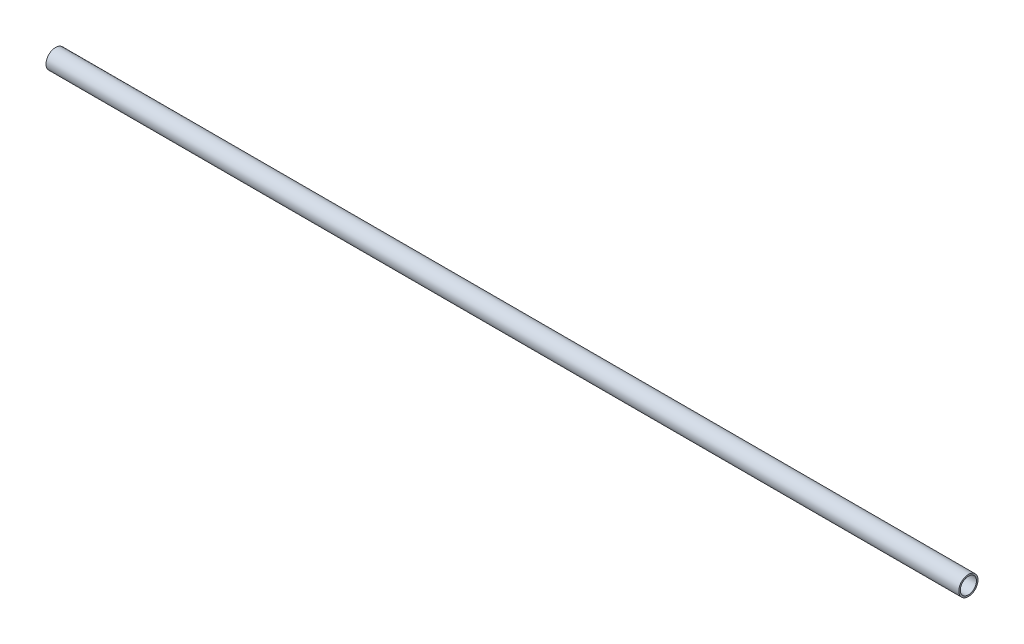
ISO-10303-21;
HEADER;
FILE_DESCRIPTION(('STEP AP214'),'2;1');
FILE_NAME('part.step','',(''),(''),'','','');
FILE_SCHEMA(('AUTOMOTIVE_DESIGN { 1 0 10303 214 1 1 1 1 }'));
ENDSEC;
DATA;
#1=APPLICATION_CONTEXT('core data for automotive mechanical design processes');
#2=APPLICATION_PROTOCOL_DEFINITION('international standard','automotive_design',2000,#1);
#3=PRODUCT_CONTEXT('',#1,'mechanical');
#4=PRODUCT('Part','Part','',(#3));
#5=PRODUCT_RELATED_PRODUCT_CATEGORY('part','',(#4));
#6=PRODUCT_DEFINITION_FORMATION('','',#4);
#7=PRODUCT_DEFINITION_CONTEXT('part definition',#1,'design');
#8=PRODUCT_DEFINITION('design','',#6,#7);
#9=PRODUCT_DEFINITION_SHAPE('','',#8);
#10=(LENGTH_UNIT() NAMED_UNIT(*) SI_UNIT(.MILLI.,.METRE.));
#11=(NAMED_UNIT(*) PLANE_ANGLE_UNIT() SI_UNIT($,.RADIAN.));
#12=(NAMED_UNIT(*) SI_UNIT($,.STERADIAN.) SOLID_ANGLE_UNIT());
#13=UNCERTAINTY_MEASURE_WITH_UNIT(LENGTH_MEASURE(1.E-05),#10,'distance_accuracy_value','');
#14=(GEOMETRIC_REPRESENTATION_CONTEXT(3) GLOBAL_UNCERTAINTY_ASSIGNED_CONTEXT((#13)) GLOBAL_UNIT_ASSIGNED_CONTEXT((#10,
#11,#12)) REPRESENTATION_CONTEXT('',''));
#15=CARTESIAN_POINT('',(0.,0.,0.));
#16=DIRECTION('',(0.,0.,1.));
#17=DIRECTION('',(1.,0.,0.));
#18=AXIS2_PLACEMENT_3D('',#15,#16,#17);
#19=CARTESIAN_POINT('',(-301.625,0.,0.));
#20=DIRECTION('',(1.,0.,0.));
#21=DIRECTION('',(0.,0.,1.));
#22=AXIS2_PLACEMENT_3D('',#19,#20,#21);
#23=CYLINDRICAL_SURFACE('',#22,3.175);
#24=CARTESIAN_POINT('',(-301.625,0.,0.));
#25=DIRECTION('',(-1.,0.,0.));
#26=DIRECTION('',(0.,0.,1.));
#27=AXIS2_PLACEMENT_3D('',#24,#25,#26);
#28=CIRCLE('',#27,3.175);
#29=CARTESIAN_POINT('',(-301.625,0.,3.175));
#30=VERTEX_POINT('',#29);
#31=EDGE_CURVE('E10',#30,#30,#28,.T.);
#32=ORIENTED_EDGE('',*,*,#31,.F.);
#33=EDGE_LOOP('',(#32));
#34=FACE_BOUND('',#33,.T.);
#35=CARTESIAN_POINT('',(0.,0.,0.));
#36=DIRECTION('',(-1.,0.,0.));
#37=DIRECTION('',(0.,0.,1.));
#38=AXIS2_PLACEMENT_3D('',#35,#36,#37);
#39=CIRCLE('',#38,3.175);
#40=CARTESIAN_POINT('',(0.,0.,3.175));
#41=VERTEX_POINT('',#40);
#42=EDGE_CURVE('E42',#41,#41,#39,.T.);
#43=ORIENTED_EDGE('',*,*,#42,.T.);
#44=EDGE_LOOP('',(#43));
#45=FACE_BOUND('',#44,.T.);
#46=ADVANCED_FACE('F39',(#34,#45),#23,.T.);
#47=CARTESIAN_POINT('',(-301.625,0.,0.));
#48=DIRECTION('',(1.,0.,0.));
#49=DIRECTION('',(0.,0.,1.));
#50=AXIS2_PLACEMENT_3D('',#47,#48,#49);
#51=PLANE('',#50);
#52=CARTESIAN_POINT('',(-301.625,0.,0.));
#53=DIRECTION('',(-1.,0.,0.));
#54=DIRECTION('',(0.,0.,1.));
#55=AXIS2_PLACEMENT_3D('',#52,#53,#54);
#56=CIRCLE('',#55,2.667);
#57=CARTESIAN_POINT('',(-301.625,0.,2.667));
#58=VERTEX_POINT('',#57);
#59=EDGE_CURVE('E49',#58,#58,#56,.T.);
#60=ORIENTED_EDGE('',*,*,#59,.F.);
#61=EDGE_LOOP('',(#60));
#62=FACE_BOUND('',#61,.T.);
#63=ORIENTED_EDGE('',*,*,#31,.T.);
#64=EDGE_LOOP('',(#63));
#65=FACE_BOUND('',#64,.T.);
#66=ADVANCED_FACE('F60',(#62,#65),#51,.F.);
#67=CARTESIAN_POINT('',(0.,0.,0.));
#68=DIRECTION('',(1.,0.,0.));
#69=DIRECTION('',(0.,0.,1.));
#70=AXIS2_PLACEMENT_3D('',#67,#68,#69);
#71=PLANE('',#70);
#72=CARTESIAN_POINT('',(0.,0.,0.));
#73=DIRECTION('',(-1.,0.,0.));
#74=DIRECTION('',(0.,0.,1.));
#75=AXIS2_PLACEMENT_3D('',#72,#73,#74);
#76=CIRCLE('',#75,2.667);
#77=CARTESIAN_POINT('',(0.,0.,2.667));
#78=VERTEX_POINT('',#77);
#79=EDGE_CURVE('E51',#78,#78,#76,.T.);
#80=ORIENTED_EDGE('',*,*,#79,.T.);
#81=EDGE_LOOP('',(#80));
#82=FACE_BOUND('',#81,.T.);
#83=ORIENTED_EDGE('',*,*,#42,.F.);
#84=EDGE_LOOP('',(#83));
#85=FACE_BOUND('',#84,.T.);
#86=ADVANCED_FACE('F62',(#82,#85),#71,.T.);
#87=CARTESIAN_POINT('',(-301.625,0.,0.));
#88=DIRECTION('',(1.,0.,0.));
#89=DIRECTION('',(0.,0.,1.));
#90=AXIS2_PLACEMENT_3D('',#87,#88,#89);
#91=CYLINDRICAL_SURFACE('',#90,2.667);
#92=ORIENTED_EDGE('',*,*,#59,.T.);
#93=EDGE_LOOP('',(#92));
#94=FACE_BOUND('',#93,.T.);
#95=ORIENTED_EDGE('',*,*,#79,.F.);
#96=EDGE_LOOP('',(#95));
#97=FACE_BOUND('',#96,.T.);
#98=ADVANCED_FACE('F57',(#94,#97),#91,.F.);
#99=CLOSED_SHELL('',(#46,#66,#86,#98));
#100=MANIFOLD_SOLID_BREP('B2',#99);
#101=ADVANCED_BREP_SHAPE_REPRESENTATION('',(#18,#100),#14);
#102=SHAPE_DEFINITION_REPRESENTATION(#9,#101);
ENDSEC;
END-ISO-10303-21;
